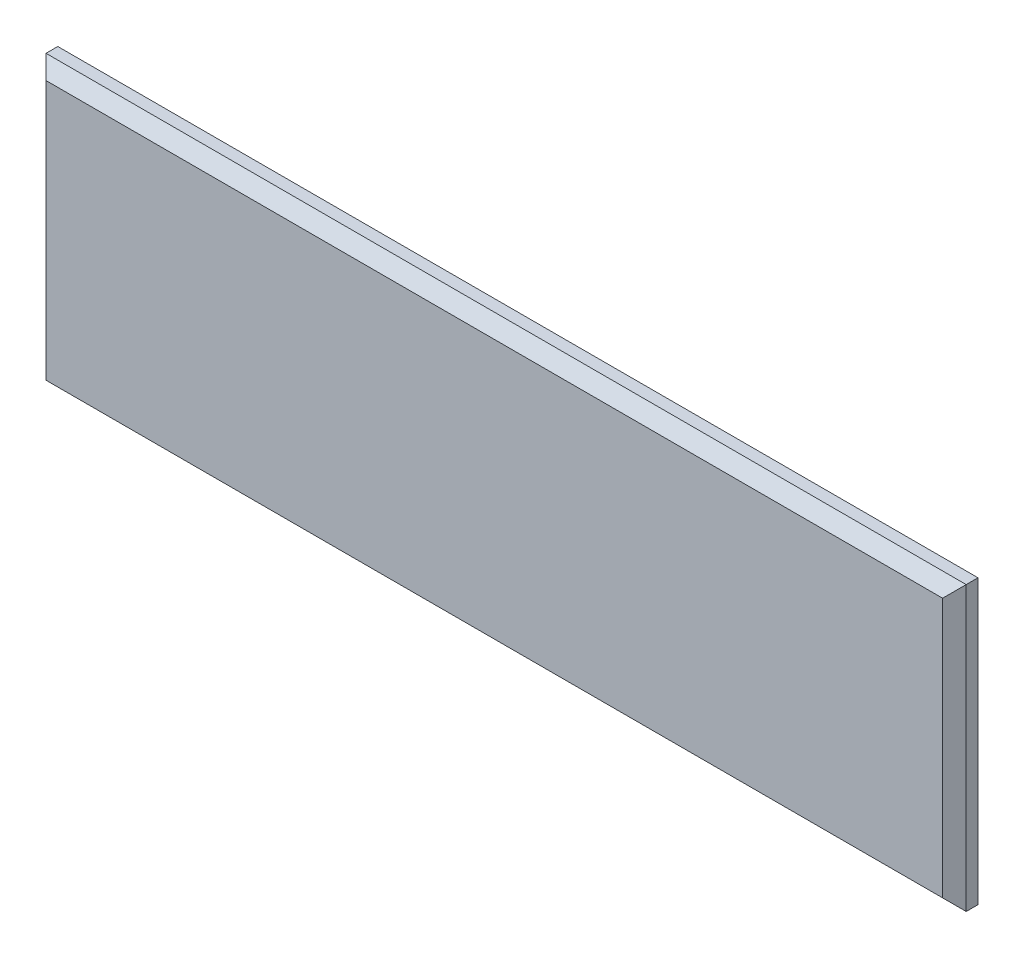
ISO-10303-21;
HEADER;
FILE_DESCRIPTION(('STEP AP214'),'2;1');
FILE_NAME('part.step','',(''),(''),'','','');
FILE_SCHEMA(('AUTOMOTIVE_DESIGN { 1 0 10303 214 1 1 1 1 }'));
ENDSEC;
DATA;
#1=APPLICATION_CONTEXT('core data for automotive mechanical design processes');
#2=APPLICATION_PROTOCOL_DEFINITION('international standard','automotive_design',2000,#1);
#3=PRODUCT_CONTEXT('',#1,'mechanical');
#4=PRODUCT('Part','Part','',(#3));
#5=PRODUCT_RELATED_PRODUCT_CATEGORY('part','',(#4));
#6=PRODUCT_DEFINITION_FORMATION('','',#4);
#7=PRODUCT_DEFINITION_CONTEXT('part definition',#1,'design');
#8=PRODUCT_DEFINITION('design','',#6,#7);
#9=PRODUCT_DEFINITION_SHAPE('','',#8);
#10=(LENGTH_UNIT() NAMED_UNIT(*) SI_UNIT(.MILLI.,.METRE.));
#11=(NAMED_UNIT(*) PLANE_ANGLE_UNIT() SI_UNIT($,.RADIAN.));
#12=(NAMED_UNIT(*) SI_UNIT($,.STERADIAN.) SOLID_ANGLE_UNIT());
#13=UNCERTAINTY_MEASURE_WITH_UNIT(LENGTH_MEASURE(1.E-05),#10,'distance_accuracy_value','');
#14=(GEOMETRIC_REPRESENTATION_CONTEXT(3) GLOBAL_UNCERTAINTY_ASSIGNED_CONTEXT((#13)) GLOBAL_UNIT_ASSIGNED_CONTEXT((#10,
#11,#12)) REPRESENTATION_CONTEXT('',''));
#15=CARTESIAN_POINT('',(0.,0.,0.));
#16=DIRECTION('',(0.,0.,1.));
#17=DIRECTION('',(1.,0.,0.));
#18=AXIS2_PLACEMENT_3D('',#15,#16,#17);
#19=CARTESIAN_POINT('',(495.3,-152.4,25.4));
#20=DIRECTION('',(-1.,0.,0.));
#21=DIRECTION('',(0.,0.,1.));
#22=AXIS2_PLACEMENT_3D('',#19,#20,#21);
#23=PLANE('',#22);
#24=DIRECTION('',(0.,0.,-1.));
#25=VECTOR('',#24,1.);
#26=CARTESIAN_POINT('',(495.3,152.4,25.4));
#27=LINE('',#26,#25);
#28=CARTESIAN_POINT('',(495.3,152.4,12.7000000000001));
#29=VERTEX_POINT('',#28);
#30=CARTESIAN_POINT('',(495.3,152.4,0.));
#31=VERTEX_POINT('',#30);
#32=EDGE_CURVE('E89',#29,#31,#27,.T.);
#33=ORIENTED_EDGE('',*,*,#32,.F.);
#34=DIRECTION('',(0.,-1.,0.));
#35=VECTOR('',#34,1.);
#36=CARTESIAN_POINT('',(495.3,-152.4,12.7000000000001));
#37=LINE('',#36,#35);
#38=CARTESIAN_POINT('',(495.3,-152.4,12.7000000000001));
#39=VERTEX_POINT('',#38);
#40=EDGE_CURVE('E11',#29,#39,#37,.T.);
#41=ORIENTED_EDGE('',*,*,#40,.T.);
#42=DIRECTION('',(0.,0.,-1.));
#43=VECTOR('',#42,1.);
#44=CARTESIAN_POINT('',(495.3,-152.4,25.4));
#45=LINE('',#44,#43);
#46=CARTESIAN_POINT('',(495.3,-152.4,0.));
#47=VERTEX_POINT('',#46);
#48=EDGE_CURVE('E109',#39,#47,#45,.T.);
#49=ORIENTED_EDGE('',*,*,#48,.T.);
#50=DIRECTION('',(0.,1.,0.));
#51=VECTOR('',#50,1.);
#52=CARTESIAN_POINT('',(495.3,-152.4,0.));
#53=LINE('',#52,#51);
#54=EDGE_CURVE('E104',#47,#31,#53,.T.);
#55=ORIENTED_EDGE('',*,*,#54,.T.);
#56=EDGE_LOOP('',(#33,#41,#49,#55));
#57=FACE_BOUND('',#56,.T.);
#58=ADVANCED_FACE('F37',(#57),#23,.F.);
#59=CARTESIAN_POINT('',(-495.3,152.4,25.4));
#60=DIRECTION('',(0.,-1.,0.));
#61=DIRECTION('',(0.,0.,-1.));
#62=AXIS2_PLACEMENT_3D('',#59,#60,#61);
#63=PLANE('',#62);
#64=DIRECTION('',(0.,0.,-1.));
#65=VECTOR('',#64,1.);
#66=CARTESIAN_POINT('',(-495.3,152.4,25.4));
#67=LINE('',#66,#65);
#68=CARTESIAN_POINT('',(-495.3,152.4,12.7000000000001));
#69=VERTEX_POINT('',#68);
#70=CARTESIAN_POINT('',(-495.3,152.4,0.));
#71=VERTEX_POINT('',#70);
#72=EDGE_CURVE('E98',#69,#71,#67,.T.);
#73=ORIENTED_EDGE('',*,*,#72,.F.);
#74=DIRECTION('',(1.,0.,0.));
#75=VECTOR('',#74,1.);
#76=CARTESIAN_POINT('',(-495.3,152.4,12.7000000000001));
#77=LINE('',#76,#75);
#78=EDGE_CURVE('E46',#69,#29,#77,.T.);
#79=ORIENTED_EDGE('',*,*,#78,.T.);
#80=ORIENTED_EDGE('',*,*,#32,.T.);
#81=DIRECTION('',(-1.,0.,0.));
#82=VECTOR('',#81,1.);
#83=CARTESIAN_POINT('',(-495.3,152.4,0.));
#84=LINE('',#83,#82);
#85=EDGE_CURVE('E92',#31,#71,#84,.T.);
#86=ORIENTED_EDGE('',*,*,#85,.T.);
#87=EDGE_LOOP('',(#73,#79,#80,#86));
#88=FACE_BOUND('',#87,.T.);
#89=ADVANCED_FACE('F91',(#88),#63,.F.);
#90=CARTESIAN_POINT('',(-495.3,-152.4,25.4));
#91=DIRECTION('',(1.,0.,0.));
#92=DIRECTION('',(0.,0.,-1.));
#93=AXIS2_PLACEMENT_3D('',#90,#91,#92);
#94=PLANE('',#93);
#95=DIRECTION('',(0.,0.,-1.));
#96=VECTOR('',#95,1.);
#97=CARTESIAN_POINT('',(-495.3,-152.4,25.4));
#98=LINE('',#97,#96);
#99=CARTESIAN_POINT('',(-495.3,-152.4,12.7000000000001));
#100=VERTEX_POINT('',#99);
#101=CARTESIAN_POINT('',(-495.3,-152.4,0.));
#102=VERTEX_POINT('',#101);
#103=EDGE_CURVE('E119',#100,#102,#98,.T.);
#104=ORIENTED_EDGE('',*,*,#103,.F.);
#105=DIRECTION('',(0.,1.,0.));
#106=VECTOR('',#105,1.);
#107=CARTESIAN_POINT('',(-495.3,-152.4,12.7000000000001));
#108=LINE('',#107,#106);
#109=EDGE_CURVE('E61',#100,#69,#108,.T.);
#110=ORIENTED_EDGE('',*,*,#109,.T.);
#111=ORIENTED_EDGE('',*,*,#72,.T.);
#112=DIRECTION('',(0.,-1.,0.));
#113=VECTOR('',#112,1.);
#114=CARTESIAN_POINT('',(-495.3,-152.4,0.));
#115=LINE('',#114,#113);
#116=EDGE_CURVE('E106',#71,#102,#115,.T.);
#117=ORIENTED_EDGE('',*,*,#116,.T.);
#118=EDGE_LOOP('',(#104,#110,#111,#117));
#119=FACE_BOUND('',#118,.T.);
#120=ADVANCED_FACE('F157',(#119),#94,.F.);
#121=CARTESIAN_POINT('',(-495.3,-152.4,25.4));
#122=DIRECTION('',(0.,1.,0.));
#123=DIRECTION('',(0.,0.,1.));
#124=AXIS2_PLACEMENT_3D('',#121,#122,#123);
#125=PLANE('',#124);
#126=ORIENTED_EDGE('',*,*,#48,.F.);
#127=DIRECTION('',(-1.,0.,0.));
#128=VECTOR('',#127,1.);
#129=CARTESIAN_POINT('',(-495.3,-152.4,12.7000000000001));
#130=LINE('',#129,#128);
#131=EDGE_CURVE('E130',#39,#100,#130,.T.);
#132=ORIENTED_EDGE('',*,*,#131,.T.);
#133=ORIENTED_EDGE('',*,*,#103,.T.);
#134=DIRECTION('',(1.,0.,0.));
#135=VECTOR('',#134,1.);
#136=CARTESIAN_POINT('',(-495.3,-152.4,0.));
#137=LINE('',#136,#135);
#138=EDGE_CURVE('E116',#102,#47,#137,.T.);
#139=ORIENTED_EDGE('',*,*,#138,.T.);
#140=EDGE_LOOP('',(#126,#132,#133,#139));
#141=FACE_BOUND('',#140,.T.);
#142=ADVANCED_FACE('F156',(#141),#125,.F.);
#143=CARTESIAN_POINT('',(0.,0.,25.4));
#144=DIRECTION('',(0.,0.,-1.));
#145=DIRECTION('',(-1.,0.,0.));
#146=AXIS2_PLACEMENT_3D('',#143,#144,#145);
#147=PLANE('',#146);
#148=DIRECTION('',(0.,-1.,0.));
#149=VECTOR('',#148,1.);
#150=CARTESIAN_POINT('',(-482.6,0.,25.4));
#151=LINE('',#150,#149);
#152=CARTESIAN_POINT('',(-482.6,139.7,25.4));
#153=VERTEX_POINT('',#152);
#154=CARTESIAN_POINT('',(-482.6,-139.7,25.4));
#155=VERTEX_POINT('',#154);
#156=EDGE_CURVE('E125',#153,#155,#151,.T.);
#157=ORIENTED_EDGE('',*,*,#156,.T.);
#158=DIRECTION('',(1.,0.,0.));
#159=VECTOR('',#158,1.);
#160=CARTESIAN_POINT('',(0.,-139.7,25.4));
#161=LINE('',#160,#159);
#162=CARTESIAN_POINT('',(482.6,-139.7,25.4));
#163=VERTEX_POINT('',#162);
#164=EDGE_CURVE('E127',#155,#163,#161,.T.);
#165=ORIENTED_EDGE('',*,*,#164,.T.);
#166=DIRECTION('',(0.,1.,0.));
#167=VECTOR('',#166,1.);
#168=CARTESIAN_POINT('',(482.6,0.,25.4));
#169=LINE('',#168,#167);
#170=CARTESIAN_POINT('',(482.6,139.7,25.4));
#171=VERTEX_POINT('',#170);
#172=EDGE_CURVE('E97',#163,#171,#169,.T.);
#173=ORIENTED_EDGE('',*,*,#172,.T.);
#174=DIRECTION('',(-1.,0.,0.));
#175=VECTOR('',#174,1.);
#176=CARTESIAN_POINT('',(0.,139.7,25.4));
#177=LINE('',#176,#175);
#178=EDGE_CURVE('E123',#171,#153,#177,.T.);
#179=ORIENTED_EDGE('',*,*,#178,.T.);
#180=EDGE_LOOP('',(#157,#165,#173,#179));
#181=FACE_BOUND('',#180,.T.);
#182=ADVANCED_FACE('F149',(#181),#147,.F.);
#183=CARTESIAN_POINT('',(0.,0.,0.));
#184=DIRECTION('',(0.,0.,-1.));
#185=DIRECTION('',(-1.,0.,0.));
#186=AXIS2_PLACEMENT_3D('',#183,#184,#185);
#187=PLANE('',#186);
#188=ORIENTED_EDGE('',*,*,#54,.F.);
#189=ORIENTED_EDGE('',*,*,#138,.F.);
#190=ORIENTED_EDGE('',*,*,#116,.F.);
#191=ORIENTED_EDGE('',*,*,#85,.F.);
#192=EDGE_LOOP('',(#188,#189,#190,#191));
#193=FACE_BOUND('',#192,.T.);
#194=ADVANCED_FACE('F102',(#193),#187,.T.);
#195=CARTESIAN_POINT('',(0.,139.7,25.4));
#196=DIRECTION('',(0.,-0.707106781186548,-0.707106781186548));
#197=DIRECTION('',(-1.,0.,0.));
#198=AXIS2_PLACEMENT_3D('',#195,#196,#197);
#199=PLANE('',#198);
#200=DIRECTION('',(-0.577350269189626,-0.577350269189626,0.577350269189626));
#201=VECTOR('',#200,1.);
#202=CARTESIAN_POINT('',(436.033333333333,93.1333333333333,71.9666666666667));
#203=LINE('',#202,#201);
#204=EDGE_CURVE('E113',#29,#171,#203,.T.);
#205=ORIENTED_EDGE('',*,*,#204,.F.);
#206=ORIENTED_EDGE('',*,*,#78,.F.);
#207=DIRECTION('',(0.577350269189626,-0.577350269189626,0.577350269189626));
#208=VECTOR('',#207,1.);
#209=CARTESIAN_POINT('',(-321.733333333333,-21.1666666666666,186.266666666667));
#210=LINE('',#209,#208);
#211=EDGE_CURVE('E41',#153,#69,#210,.F.);
#212=ORIENTED_EDGE('',*,*,#211,.F.);
#213=ORIENTED_EDGE('',*,*,#178,.F.);
#214=EDGE_LOOP('',(#205,#206,#212,#213));
#215=FACE_BOUND('',#214,.T.);
#216=ADVANCED_FACE('F39',(#215),#199,.F.);
#217=CARTESIAN_POINT('',(-482.6,0.,25.4));
#218=DIRECTION('',(0.707106781186548,0.,-0.707106781186548));
#219=DIRECTION('',(0.,-1.,0.));
#220=AXIS2_PLACEMENT_3D('',#217,#218,#219);
#221=PLANE('',#220);
#222=ORIENTED_EDGE('',*,*,#211,.T.);
#223=ORIENTED_EDGE('',*,*,#109,.F.);
#224=DIRECTION('',(0.577350269189626,0.577350269189626,0.577350269189626));
#225=VECTOR('',#224,1.);
#226=CARTESIAN_POINT('',(-436.033333333333,-93.1333333333334,71.9666666666667));
#227=LINE('',#226,#225);
#228=EDGE_CURVE('E137',#155,#100,#227,.F.);
#229=ORIENTED_EDGE('',*,*,#228,.F.);
#230=ORIENTED_EDGE('',*,*,#156,.F.);
#231=EDGE_LOOP('',(#222,#223,#229,#230));
#232=FACE_BOUND('',#231,.T.);
#233=ADVANCED_FACE('F174',(#232),#221,.F.);
#234=CARTESIAN_POINT('',(482.6,0.,25.4));
#235=DIRECTION('',(-0.707106781186548,0.,-0.707106781186548));
#236=DIRECTION('',(0.,1.,0.));
#237=AXIS2_PLACEMENT_3D('',#234,#235,#236);
#238=PLANE('',#237);
#239=ORIENTED_EDGE('',*,*,#204,.T.);
#240=ORIENTED_EDGE('',*,*,#172,.F.);
#241=DIRECTION('',(0.577350269189626,-0.577350269189626,-0.577350269189626));
#242=VECTOR('',#241,1.);
#243=CARTESIAN_POINT('',(436.033333333333,-93.1333333333334,71.9666666666667));
#244=LINE('',#243,#242);
#245=EDGE_CURVE('E135',#39,#163,#244,.F.);
#246=ORIENTED_EDGE('',*,*,#245,.F.);
#247=ORIENTED_EDGE('',*,*,#40,.F.);
#248=EDGE_LOOP('',(#239,#240,#246,#247));
#249=FACE_BOUND('',#248,.T.);
#250=ADVANCED_FACE('F142',(#249),#238,.F.);
#251=CARTESIAN_POINT('',(0.,-139.7,25.4));
#252=DIRECTION('',(0.,0.707106781186548,-0.707106781186548));
#253=DIRECTION('',(1.,0.,0.));
#254=AXIS2_PLACEMENT_3D('',#251,#252,#253);
#255=PLANE('',#254);
#256=ORIENTED_EDGE('',*,*,#228,.T.);
#257=ORIENTED_EDGE('',*,*,#131,.F.);
#258=ORIENTED_EDGE('',*,*,#245,.T.);
#259=ORIENTED_EDGE('',*,*,#164,.F.);
#260=EDGE_LOOP('',(#256,#257,#258,#259));
#261=FACE_BOUND('',#260,.T.);
#262=ADVANCED_FACE('F153',(#261),#255,.F.);
#263=CLOSED_SHELL('',(#58,#89,#120,#142,#182,#194,#216,#233,#250,#262));
#264=MANIFOLD_SOLID_BREP('B2',#263);
#265=ADVANCED_BREP_SHAPE_REPRESENTATION('',(#18,#264),#14);
#266=SHAPE_DEFINITION_REPRESENTATION(#9,#265);
ENDSEC;
END-ISO-10303-21;
